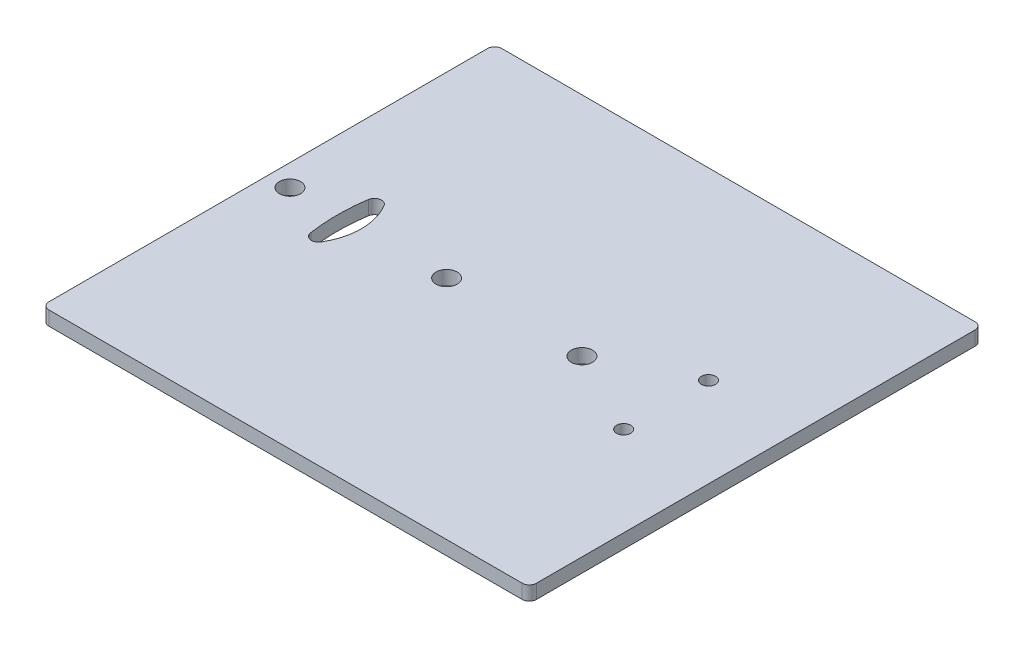
ISO-10303-21;
HEADER;
FILE_DESCRIPTION(('STEP AP214'),'2;1');
FILE_NAME('part.step','',(''),(''),'','','');
FILE_SCHEMA(('AUTOMOTIVE_DESIGN { 1 0 10303 214 1 1 1 1 }'));
ENDSEC;
DATA;
#1=APPLICATION_CONTEXT('core data for automotive mechanical design processes');
#2=APPLICATION_PROTOCOL_DEFINITION('international standard','automotive_design',2000,#1);
#3=PRODUCT_CONTEXT('',#1,'mechanical');
#4=PRODUCT('Part','Part','',(#3));
#5=PRODUCT_RELATED_PRODUCT_CATEGORY('part','',(#4));
#6=PRODUCT_DEFINITION_FORMATION('','',#4);
#7=PRODUCT_DEFINITION_CONTEXT('part definition',#1,'design');
#8=PRODUCT_DEFINITION('design','',#6,#7);
#9=PRODUCT_DEFINITION_SHAPE('','',#8);
#10=(LENGTH_UNIT() NAMED_UNIT(*) SI_UNIT(.MILLI.,.METRE.));
#11=(NAMED_UNIT(*) PLANE_ANGLE_UNIT() SI_UNIT($,.RADIAN.));
#12=(NAMED_UNIT(*) SI_UNIT($,.STERADIAN.) SOLID_ANGLE_UNIT());
#13=UNCERTAINTY_MEASURE_WITH_UNIT(LENGTH_MEASURE(1.E-05),#10,'distance_accuracy_value','');
#14=(GEOMETRIC_REPRESENTATION_CONTEXT(3) GLOBAL_UNCERTAINTY_ASSIGNED_CONTEXT((#13)) GLOBAL_UNIT_ASSIGNED_CONTEXT((#10,
#11,#12)) REPRESENTATION_CONTEXT('',''));
#15=CARTESIAN_POINT('',(0.,0.,0.));
#16=DIRECTION('',(0.,0.,1.));
#17=DIRECTION('',(1.,0.,0.));
#18=AXIS2_PLACEMENT_3D('',#15,#16,#17);
#19=CARTESIAN_POINT('',(-0.529110391776749,2.,0.));
#20=DIRECTION('',(-1.,0.,0.));
#21=DIRECTION('',(0.,0.,1.));
#22=AXIS2_PLACEMENT_3D('',#19,#20,#21);
#23=PLANE('',#22);
#24=DIRECTION('',(0.,0.,-1.));
#25=VECTOR('',#24,1.);
#26=CARTESIAN_POINT('',(-0.529110391776749,0.,0.));
#27=LINE('',#26,#25);
#28=CARTESIAN_POINT('',(-0.529110391776749,0.,30.3399870721143));
#29=VERTEX_POINT('',#28);
#30=CARTESIAN_POINT('',(-0.529110391776749,0.,-31.7592451910248));
#31=VERTEX_POINT('',#30);
#32=EDGE_CURVE('E198',#29,#31,#27,.T.);
#33=ORIENTED_EDGE('',*,*,#32,.T.);
#34=DIRECTION('',(0.,-1.,0.));
#35=VECTOR('',#34,1.);
#36=CARTESIAN_POINT('',(-0.529110391776749,2.,-31.7592451910248));
#37=LINE('',#36,#35);
#38=CARTESIAN_POINT('',(-0.529110391776749,2.,-31.7592451910248));
#39=VERTEX_POINT('',#38);
#40=EDGE_CURVE('E229',#31,#39,#37,.F.);
#41=ORIENTED_EDGE('',*,*,#40,.T.);
#42=DIRECTION('',(0.,0.,-1.));
#43=VECTOR('',#42,1.);
#44=CARTESIAN_POINT('',(-0.529110391776749,2.,0.));
#45=LINE('',#44,#43);
#46=CARTESIAN_POINT('',(-0.529110391776749,2.,30.3399870721143));
#47=VERTEX_POINT('',#46);
#48=EDGE_CURVE('E163',#47,#39,#45,.T.);
#49=ORIENTED_EDGE('',*,*,#48,.F.);
#50=DIRECTION('',(0.,-1.,0.));
#51=VECTOR('',#50,1.);
#52=CARTESIAN_POINT('',(-0.529110391776749,2.,30.3399870721143));
#53=LINE('',#52,#51);
#54=EDGE_CURVE('E226',#47,#29,#53,.T.);
#55=ORIENTED_EDGE('',*,*,#54,.T.);
#56=EDGE_LOOP('',(#33,#41,#49,#55));
#57=FACE_BOUND('',#56,.T.);
#58=ADVANCED_FACE('F39',(#57),#23,.F.);
#59=CARTESIAN_POINT('',(0.,2.,-32.7592451910248));
#60=DIRECTION('',(0.,0.,1.));
#61=DIRECTION('',(1.,0.,0.));
#62=AXIS2_PLACEMENT_3D('',#59,#60,#61);
#63=PLANE('',#62);
#64=DIRECTION('',(-1.,0.,0.));
#65=VECTOR('',#64,1.);
#66=CARTESIAN_POINT('',(0.,2.,-32.7592451910248));
#67=LINE('',#66,#65);
#68=CARTESIAN_POINT('',(-1.52911039177675,2.,-32.7592451910248));
#69=VERTEX_POINT('',#68);
#70=CARTESIAN_POINT('',(-68.5291103917768,2.,-32.7592451910248));
#71=VERTEX_POINT('',#70);
#72=EDGE_CURVE('E166',#69,#71,#67,.T.);
#73=ORIENTED_EDGE('',*,*,#72,.F.);
#74=DIRECTION('',(0.,-1.,0.));
#75=VECTOR('',#74,1.);
#76=CARTESIAN_POINT('',(-1.52911039177675,2.,-32.7592451910248));
#77=LINE('',#76,#75);
#78=CARTESIAN_POINT('',(-1.52911039177675,0.,-32.7592451910248));
#79=VERTEX_POINT('',#78);
#80=EDGE_CURVE('E215',#69,#79,#77,.T.);
#81=ORIENTED_EDGE('',*,*,#80,.T.);
#82=DIRECTION('',(-1.,0.,0.));
#83=VECTOR('',#82,1.);
#84=CARTESIAN_POINT('',(0.,0.,-32.7592451910248));
#85=LINE('',#84,#83);
#86=CARTESIAN_POINT('',(-68.5291103917768,0.,-32.7592451910248));
#87=VERTEX_POINT('',#86);
#88=EDGE_CURVE('E201',#79,#87,#85,.T.);
#89=ORIENTED_EDGE('',*,*,#88,.T.);
#90=DIRECTION('',(0.,-1.,0.));
#91=VECTOR('',#90,1.);
#92=CARTESIAN_POINT('',(-68.5291103917768,2.,-32.7592451910248));
#93=LINE('',#92,#91);
#94=EDGE_CURVE('E139',#87,#71,#93,.F.);
#95=ORIENTED_EDGE('',*,*,#94,.T.);
#96=EDGE_LOOP('',(#73,#81,#89,#95));
#97=FACE_BOUND('',#96,.T.);
#98=ADVANCED_FACE('F265',(#97),#63,.F.);
#99=CARTESIAN_POINT('',(-69.5291103917768,2.,0.));
#100=DIRECTION('',(1.,0.,0.));
#101=DIRECTION('',(0.,0.,-1.));
#102=AXIS2_PLACEMENT_3D('',#99,#100,#101);
#103=PLANE('',#102);
#104=DIRECTION('',(0.,0.,1.));
#105=VECTOR('',#104,1.);
#106=CARTESIAN_POINT('',(-69.5291103917768,2.,0.));
#107=LINE('',#106,#105);
#108=CARTESIAN_POINT('',(-69.5291103917768,2.,-31.7592451910248));
#109=VERTEX_POINT('',#108);
#110=CARTESIAN_POINT('',(-69.5291103917768,2.,30.3399870721143));
#111=VERTEX_POINT('',#110);
#112=EDGE_CURVE('E169',#109,#111,#107,.T.);
#113=ORIENTED_EDGE('',*,*,#112,.F.);
#114=DIRECTION('',(0.,-1.,0.));
#115=VECTOR('',#114,1.);
#116=CARTESIAN_POINT('',(-69.5291103917768,2.,-31.7592451910248));
#117=LINE('',#116,#115);
#118=CARTESIAN_POINT('',(-69.5291103917768,0.,-31.7592451910248));
#119=VERTEX_POINT('',#118);
#120=EDGE_CURVE('E240',#109,#119,#117,.T.);
#121=ORIENTED_EDGE('',*,*,#120,.T.);
#122=DIRECTION('',(0.,0.,1.));
#123=VECTOR('',#122,1.);
#124=CARTESIAN_POINT('',(-69.5291103917768,0.,0.));
#125=LINE('',#124,#123);
#126=CARTESIAN_POINT('',(-69.5291103917768,0.,30.3399870721143));
#127=VERTEX_POINT('',#126);
#128=EDGE_CURVE('E204',#119,#127,#125,.T.);
#129=ORIENTED_EDGE('',*,*,#128,.T.);
#130=DIRECTION('',(0.,-1.,0.));
#131=VECTOR('',#130,1.);
#132=CARTESIAN_POINT('',(-69.5291103917768,2.,30.3399870721143));
#133=LINE('',#132,#131);
#134=EDGE_CURVE('E238',#127,#111,#133,.F.);
#135=ORIENTED_EDGE('',*,*,#134,.T.);
#136=EDGE_LOOP('',(#113,#121,#129,#135));
#137=FACE_BOUND('',#136,.T.);
#138=ADVANCED_FACE('F273',(#137),#103,.F.);
#139=CARTESIAN_POINT('',(-32.4352056165024,2.,-0.709629059459614));
#140=DIRECTION('',(0.,-1.,0.));
#141=DIRECTION('',(0.,0.,-1.));
#142=AXIS2_PLACEMENT_3D('',#139,#140,#141);
#143=CYLINDRICAL_SURFACE('',#142,27.3286368918132);
#144=CARTESIAN_POINT('',(-32.4352056165024,0.,-0.709629059459614));
#145=DIRECTION('',(0.,1.,0.));
#146=DIRECTION('',(0.,0.,1.));
#147=AXIS2_PLACEMENT_3D('',#144,#145,#146);
#148=CIRCLE('',#147,27.3286368918132);
#149=CARTESIAN_POINT('',(-59.45438417212,0.,-4.81065143738257));
#150=VERTEX_POINT('',#149);
#151=CARTESIAN_POINT('',(-59.4694550126896,0.,3.29084015668525));
#152=VERTEX_POINT('',#151);
#153=EDGE_CURVE('E134',#150,#152,#148,.T.);
#154=ORIENTED_EDGE('',*,*,#153,.F.);
#155=DIRECTION('',(0.,-1.,0.));
#156=VECTOR('',#155,1.);
#157=CARTESIAN_POINT('',(-59.45438417212,2.,-4.81065143738257));
#158=LINE('',#157,#156);
#159=CARTESIAN_POINT('',(-59.45438417212,2.,-4.81065143738257));
#160=VERTEX_POINT('',#159);
#161=EDGE_CURVE('E128',#160,#150,#158,.T.);
#162=ORIENTED_EDGE('',*,*,#161,.F.);
#163=CARTESIAN_POINT('',(-32.4352056165024,2.,-0.709629059459614));
#164=DIRECTION('',(0.,1.,0.));
#165=DIRECTION('',(0.,0.,1.));
#166=AXIS2_PLACEMENT_3D('',#163,#164,#165);
#167=CIRCLE('',#166,27.3286368918132);
#168=CARTESIAN_POINT('',(-59.4694550126896,2.,3.29084015668525));
#169=VERTEX_POINT('',#168);
#170=EDGE_CURVE('E131',#160,#169,#167,.T.);
#171=ORIENTED_EDGE('',*,*,#170,.T.);
#172=DIRECTION('',(0.,-1.,0.));
#173=VECTOR('',#172,1.);
#174=CARTESIAN_POINT('',(-59.4694550126896,2.,3.29084015668525));
#175=LINE('',#174,#173);
#176=EDGE_CURVE('E173',#169,#152,#175,.T.);
#177=ORIENTED_EDGE('',*,*,#176,.T.);
#178=EDGE_LOOP('',(#154,#162,#171,#177));
#179=FACE_BOUND('',#178,.T.);
#180=ADVANCED_FACE('F130',(#179),#143,.F.);
#181=CARTESIAN_POINT('',(-58.4657077641975,2.,-4.66058824930049));
#182=DIRECTION('',(0.,-1.,0.));
#183=DIRECTION('',(0.,0.,-1.));
#184=AXIS2_PLACEMENT_3D('',#181,#182,#183);
#185=CYLINDRICAL_SURFACE('',#184,0.999999999999993);
#186=CARTESIAN_POINT('',(-58.4657077641975,0.,-4.66058824930049));
#187=DIRECTION('',(0.,1.,0.));
#188=DIRECTION('',(0.,0.,1.));
#189=AXIS2_PLACEMENT_3D('',#186,#187,#188);
#190=CIRCLE('',#189,0.999999999999993);
#191=CARTESIAN_POINT('',(-57.6114728373144,0.,-5.18047543869167));
#192=VERTEX_POINT('',#191);
#193=EDGE_CURVE('E187',#192,#150,#190,.T.);
#194=ORIENTED_EDGE('',*,*,#193,.F.);
#195=DIRECTION('',(0.,-1.,0.));
#196=VECTOR('',#195,1.);
#197=CARTESIAN_POINT('',(-57.6114728373144,2.,-5.18047543869167));
#198=LINE('',#197,#196);
#199=CARTESIAN_POINT('',(-57.6114728373144,2.,-5.18047543869167));
#200=VERTEX_POINT('',#199);
#201=EDGE_CURVE('E140',#200,#192,#198,.T.);
#202=ORIENTED_EDGE('',*,*,#201,.F.);
#203=CARTESIAN_POINT('',(-58.4657077641975,2.,-4.66058824930049));
#204=DIRECTION('',(0.,1.,0.));
#205=DIRECTION('',(0.,0.,1.));
#206=AXIS2_PLACEMENT_3D('',#203,#204,#205);
#207=CIRCLE('',#206,0.999999999999993);
#208=EDGE_CURVE('E147',#200,#160,#207,.T.);
#209=ORIENTED_EDGE('',*,*,#208,.T.);
#210=ORIENTED_EDGE('',*,*,#161,.T.);
#211=EDGE_LOOP('',(#194,#202,#209,#210));
#212=FACE_BOUND('',#211,.T.);
#213=ADVANCED_FACE('F153',(#212),#185,.F.);
#214=CARTESIAN_POINT('',(-64.957591779666,2.,-0.709629059455225));
#215=DIRECTION('',(0.,-1.,0.));
#216=DIRECTION('',(0.,0.,-1.));
#217=AXIS2_PLACEMENT_3D('',#214,#215,#216);
#218=CYLINDRICAL_SURFACE('',#217,8.59964713589512);
#219=CARTESIAN_POINT('',(-64.957591779666,0.,-0.709629059455225));
#220=DIRECTION('',(0.,1.,0.));
#221=DIRECTION('',(0.,0.,1.));
#222=AXIS2_PLACEMENT_3D('',#219,#220,#221);
#223=CIRCLE('',#222,8.59964713589512);
#224=CARTESIAN_POINT('',(-57.5568414613941,0.,3.67019120951779));
#225=VERTEX_POINT('',#224);
#226=EDGE_CURVE('E189',#225,#192,#223,.T.);
#227=ORIENTED_EDGE('',*,*,#226,.F.);
#228=DIRECTION('',(0.,-1.,0.));
#229=VECTOR('',#228,1.);
#230=CARTESIAN_POINT('',(-57.5568414613941,2.,3.67019120951779));
#231=LINE('',#230,#229);
#232=CARTESIAN_POINT('',(-57.5568414613941,2.,3.67019120951779));
#233=VERTEX_POINT('',#232);
#234=EDGE_CURVE('E211',#233,#225,#231,.T.);
#235=ORIENTED_EDGE('',*,*,#234,.F.);
#236=CARTESIAN_POINT('',(-64.957591779666,2.,-0.709629059455225));
#237=DIRECTION('',(0.,1.,0.));
#238=DIRECTION('',(0.,0.,1.));
#239=AXIS2_PLACEMENT_3D('',#236,#237,#238);
#240=CIRCLE('',#239,8.59964713589512);
#241=EDGE_CURVE('E154',#233,#200,#240,.T.);
#242=ORIENTED_EDGE('',*,*,#241,.T.);
#243=ORIENTED_EDGE('',*,*,#201,.T.);
#244=EDGE_LOOP('',(#227,#235,#242,#243));
#245=FACE_BOUND('',#244,.T.);
#246=ADVANCED_FACE('F291',(#245),#218,.F.);
#247=CARTESIAN_POINT('',(-66.457591779666,2.,-0.709629059455225));
#248=DIRECTION('',(0.,-1.,0.));
#249=DIRECTION('',(0.,0.,-1.));
#250=AXIS2_PLACEMENT_3D('',#247,#248,#249);
#251=CYLINDRICAL_SURFACE('',#250,1.5);
#252=CARTESIAN_POINT('',(-66.457591779666,2.,-0.709629059455225));
#253=DIRECTION('',(0.,1.,0.));
#254=DIRECTION('',(0.,0.,1.));
#255=AXIS2_PLACEMENT_3D('',#252,#253,#254);
#256=CIRCLE('',#255,1.5);
#257=CARTESIAN_POINT('',(-66.457591779666,2.,0.790370940544772));
#258=VERTEX_POINT('',#257);
#259=EDGE_CURVE('E160',#258,#258,#256,.T.);
#260=ORIENTED_EDGE('',*,*,#259,.T.);
#261=EDGE_LOOP('',(#260));
#262=FACE_BOUND('',#261,.T.);
#263=CARTESIAN_POINT('',(-66.457591779666,0.,-0.709629059455225));
#264=DIRECTION('',(0.,1.,0.));
#265=DIRECTION('',(0.,0.,1.));
#266=AXIS2_PLACEMENT_3D('',#263,#264,#265);
#267=CIRCLE('',#266,1.5);
#268=CARTESIAN_POINT('',(-66.457591779666,0.,0.790370940544772));
#269=VERTEX_POINT('',#268);
#270=EDGE_CURVE('E195',#269,#269,#267,.T.);
#271=ORIENTED_EDGE('',*,*,#270,.F.);
#272=EDGE_LOOP('',(#271));
#273=FACE_BOUND('',#272,.T.);
#274=ADVANCED_FACE('F287',(#262,#273),#251,.F.);
#275=CARTESIAN_POINT('',(-58.4657077641964,2.,3.24133013038831));
#276=DIRECTION('',(0.,-1.,0.));
#277=DIRECTION('',(0.,0.,-1.));
#278=AXIS2_PLACEMENT_3D('',#275,#276,#277);
#279=CYLINDRICAL_SURFACE('',#278,1.00496755249194);
#280=CARTESIAN_POINT('',(-58.4657077641964,0.,3.24133013038831));
#281=DIRECTION('',(0.,1.,0.));
#282=DIRECTION('',(0.,0.,1.));
#283=AXIS2_PLACEMENT_3D('',#280,#281,#282);
#284=CIRCLE('',#283,1.00496755249194);
#285=EDGE_CURVE('E192',#152,#225,#284,.T.);
#286=ORIENTED_EDGE('',*,*,#285,.F.);
#287=ORIENTED_EDGE('',*,*,#176,.F.);
#288=CARTESIAN_POINT('',(-58.4657077641964,2.,3.24133013038831));
#289=DIRECTION('',(0.,1.,0.));
#290=DIRECTION('',(0.,0.,1.));
#291=AXIS2_PLACEMENT_3D('',#288,#289,#290);
#292=CIRCLE('',#291,1.00496755249194);
#293=EDGE_CURVE('E150',#169,#233,#292,.T.);
#294=ORIENTED_EDGE('',*,*,#293,.T.);
#295=ORIENTED_EDGE('',*,*,#234,.T.);
#296=EDGE_LOOP('',(#286,#287,#294,#295));
#297=FACE_BOUND('',#296,.T.);
#298=ADVANCED_FACE('F290',(#297),#279,.F.);
#299=CARTESIAN_POINT('',(-44.2865932675491,2.,-0.709629059455225));
#300=DIRECTION('',(0.,-1.,0.));
#301=DIRECTION('',(0.,0.,-1.));
#302=AXIS2_PLACEMENT_3D('',#299,#300,#301);
#303=CYLINDRICAL_SURFACE('',#302,1.5);
#304=CARTESIAN_POINT('',(-44.2865932675491,2.,-0.709629059455225));
#305=DIRECTION('',(0.,1.,0.));
#306=DIRECTION('',(0.,0.,1.));
#307=AXIS2_PLACEMENT_3D('',#304,#305,#306);
#308=CIRCLE('',#307,1.5);
#309=CARTESIAN_POINT('',(-44.2865932675491,2.,0.790370940544779));
#310=VERTEX_POINT('',#309);
#311=EDGE_CURVE('E151',#310,#310,#308,.T.);
#312=ORIENTED_EDGE('',*,*,#311,.T.);
#313=EDGE_LOOP('',(#312));
#314=FACE_BOUND('',#313,.T.);
#315=CARTESIAN_POINT('',(-44.2865932675491,0.,-0.709629059455225));
#316=DIRECTION('',(0.,1.,0.));
#317=DIRECTION('',(0.,0.,1.));
#318=AXIS2_PLACEMENT_3D('',#315,#316,#317);
#319=CIRCLE('',#318,1.5);
#320=CARTESIAN_POINT('',(-44.2865932675491,0.,0.790370940544779));
#321=VERTEX_POINT('',#320);
#322=EDGE_CURVE('E183',#321,#321,#319,.T.);
#323=ORIENTED_EDGE('',*,*,#322,.F.);
#324=EDGE_LOOP('',(#323));
#325=FACE_BOUND('',#324,.T.);
#326=ADVANCED_FACE('F295',(#314,#325),#303,.F.);
#327=CARTESIAN_POINT('',(-25.1300853571439,2.,-0.709629059455225));
#328=DIRECTION('',(0.,-1.,0.));
#329=DIRECTION('',(0.,0.,-1.));
#330=AXIS2_PLACEMENT_3D('',#327,#328,#329);
#331=CYLINDRICAL_SURFACE('',#330,1.5);
#332=CARTESIAN_POINT('',(-25.1300853571439,2.,-0.709629059455225));
#333=DIRECTION('',(0.,1.,0.));
#334=DIRECTION('',(0.,0.,1.));
#335=AXIS2_PLACEMENT_3D('',#332,#333,#334);
#336=CIRCLE('',#335,1.5);
#337=CARTESIAN_POINT('',(-25.1300853571439,2.,0.790370940544775));
#338=VERTEX_POINT('',#337);
#339=EDGE_CURVE('E451',#338,#338,#336,.T.);
#340=ORIENTED_EDGE('',*,*,#339,.T.);
#341=EDGE_LOOP('',(#340));
#342=FACE_BOUND('',#341,.T.);
#343=CARTESIAN_POINT('',(-25.1300853571439,0.,-0.709629059455225));
#344=DIRECTION('',(0.,1.,0.));
#345=DIRECTION('',(0.,0.,1.));
#346=AXIS2_PLACEMENT_3D('',#343,#344,#345);
#347=CIRCLE('',#346,1.5);
#348=CARTESIAN_POINT('',(-25.1300853571439,0.,0.790370940544775));
#349=VERTEX_POINT('',#348);
#350=EDGE_CURVE('E180',#349,#349,#347,.T.);
#351=ORIENTED_EDGE('',*,*,#350,.F.);
#352=EDGE_LOOP('',(#351));
#353=FACE_BOUND('',#352,.T.);
#354=ADVANCED_FACE('F306',(#342,#353),#331,.F.);
#355=CARTESIAN_POINT('',(-13.2219858452704,2.,-6.70962905945516));
#356=DIRECTION('',(0.,-1.,0.));
#357=DIRECTION('',(0.,0.,-1.));
#358=AXIS2_PLACEMENT_3D('',#355,#356,#357);
#359=CYLINDRICAL_SURFACE('',#358,1.);
#360=CARTESIAN_POINT('',(-13.2219858452704,2.,-6.70962905945516));
#361=DIRECTION('',(0.,1.,0.));
#362=DIRECTION('',(0.,0.,1.));
#363=AXIS2_PLACEMENT_3D('',#360,#361,#362);
#364=CIRCLE('',#363,1.);
#365=CARTESIAN_POINT('',(-13.2219858452704,2.,-5.70962905945516));
#366=VERTEX_POINT('',#365);
#367=EDGE_CURVE('E447',#366,#366,#364,.T.);
#368=ORIENTED_EDGE('',*,*,#367,.T.);
#369=EDGE_LOOP('',(#368));
#370=FACE_BOUND('',#369,.T.);
#371=CARTESIAN_POINT('',(-13.2219858452704,0.,-6.70962905945516));
#372=DIRECTION('',(0.,1.,0.));
#373=DIRECTION('',(0.,0.,1.));
#374=AXIS2_PLACEMENT_3D('',#371,#372,#373);
#375=CIRCLE('',#374,1.);
#376=CARTESIAN_POINT('',(-13.2219858452704,0.,-5.70962905945516));
#377=VERTEX_POINT('',#376);
#378=EDGE_CURVE('E177',#377,#377,#375,.T.);
#379=ORIENTED_EDGE('',*,*,#378,.F.);
#380=EDGE_LOOP('',(#379));
#381=FACE_BOUND('',#380,.T.);
#382=ADVANCED_FACE('F310',(#370,#381),#359,.F.);
#383=CARTESIAN_POINT('',(-13.2219858452704,2.,5.29037094054474));
#384=DIRECTION('',(0.,-1.,0.));
#385=DIRECTION('',(0.,0.,-1.));
#386=AXIS2_PLACEMENT_3D('',#383,#384,#385);
#387=CYLINDRICAL_SURFACE('',#386,1.);
#388=CARTESIAN_POINT('',(-13.2219858452704,2.,5.29037094054474));
#389=DIRECTION('',(0.,1.,0.));
#390=DIRECTION('',(0.,0.,1.));
#391=AXIS2_PLACEMENT_3D('',#388,#389,#390);
#392=CIRCLE('',#391,1.);
#393=CARTESIAN_POINT('',(-13.2219858452704,2.,6.29037094054474));
#394=VERTEX_POINT('',#393);
#395=EDGE_CURVE('E209',#394,#394,#392,.T.);
#396=ORIENTED_EDGE('',*,*,#395,.T.);
#397=EDGE_LOOP('',(#396));
#398=FACE_BOUND('',#397,.T.);
#399=CARTESIAN_POINT('',(-13.2219858452704,0.,5.29037094054474));
#400=DIRECTION('',(0.,1.,0.));
#401=DIRECTION('',(0.,0.,1.));
#402=AXIS2_PLACEMENT_3D('',#399,#400,#401);
#403=CIRCLE('',#402,1.);
#404=CARTESIAN_POINT('',(-13.2219858452704,0.,6.29037094054474));
#405=VERTEX_POINT('',#404);
#406=EDGE_CURVE('E174',#405,#405,#403,.T.);
#407=ORIENTED_EDGE('',*,*,#406,.F.);
#408=EDGE_LOOP('',(#407));
#409=FACE_BOUND('',#408,.T.);
#410=ADVANCED_FACE('F314',(#398,#409),#387,.F.);
#411=CARTESIAN_POINT('',(0.,2.,31.3399870721143));
#412=DIRECTION('',(0.,0.,-1.));
#413=DIRECTION('',(-1.,0.,0.));
#414=AXIS2_PLACEMENT_3D('',#411,#412,#413);
#415=PLANE('',#414);
#416=DIRECTION('',(1.,0.,0.));
#417=VECTOR('',#416,1.);
#418=CARTESIAN_POINT('',(0.,0.,31.3399870721143));
#419=LINE('',#418,#417);
#420=CARTESIAN_POINT('',(-68.5291103917768,0.,31.3399870721143));
#421=VERTEX_POINT('',#420);
#422=CARTESIAN_POINT('',(-1.52911039177675,0.,31.3399870721143));
#423=VERTEX_POINT('',#422);
#424=EDGE_CURVE('E207',#421,#423,#419,.T.);
#425=ORIENTED_EDGE('',*,*,#424,.T.);
#426=DIRECTION('',(0.,-1.,0.));
#427=VECTOR('',#426,1.);
#428=CARTESIAN_POINT('',(-1.52911039177675,2.,31.3399870721143));
#429=LINE('',#428,#427);
#430=CARTESIAN_POINT('',(-1.52911039177675,2.,31.3399870721143));
#431=VERTEX_POINT('',#430);
#432=EDGE_CURVE('E11',#423,#431,#429,.F.);
#433=ORIENTED_EDGE('',*,*,#432,.T.);
#434=DIRECTION('',(1.,0.,0.));
#435=VECTOR('',#434,1.);
#436=CARTESIAN_POINT('',(0.,2.,31.3399870721143));
#437=LINE('',#436,#435);
#438=CARTESIAN_POINT('',(-68.5291103917768,2.,31.3399870721143));
#439=VERTEX_POINT('',#438);
#440=EDGE_CURVE('E171',#439,#431,#437,.T.);
#441=ORIENTED_EDGE('',*,*,#440,.F.);
#442=DIRECTION('',(0.,-1.,0.));
#443=VECTOR('',#442,1.);
#444=CARTESIAN_POINT('',(-68.5291103917768,2.,31.3399870721143));
#445=LINE('',#444,#443);
#446=EDGE_CURVE('E47',#439,#421,#445,.T.);
#447=ORIENTED_EDGE('',*,*,#446,.T.);
#448=EDGE_LOOP('',(#425,#433,#441,#447));
#449=FACE_BOUND('',#448,.T.);
#450=ADVANCED_FACE('F245',(#449),#415,.F.);
#451=CARTESIAN_POINT('',(0.,2.,0.));
#452=DIRECTION('',(0.,1.,0.));
#453=DIRECTION('',(0.,0.,1.));
#454=AXIS2_PLACEMENT_3D('',#451,#452,#453);
#455=PLANE('',#454);
#456=ORIENTED_EDGE('',*,*,#395,.F.);
#457=EDGE_LOOP('',(#456));
#458=FACE_BOUND('',#457,.T.);
#459=ORIENTED_EDGE('',*,*,#367,.F.);
#460=EDGE_LOOP('',(#459));
#461=FACE_BOUND('',#460,.T.);
#462=ORIENTED_EDGE('',*,*,#339,.F.);
#463=EDGE_LOOP('',(#462));
#464=FACE_BOUND('',#463,.T.);
#465=ORIENTED_EDGE('',*,*,#311,.F.);
#466=EDGE_LOOP('',(#465));
#467=FACE_BOUND('',#466,.T.);
#468=ORIENTED_EDGE('',*,*,#170,.F.);
#469=ORIENTED_EDGE('',*,*,#208,.F.);
#470=ORIENTED_EDGE('',*,*,#241,.F.);
#471=ORIENTED_EDGE('',*,*,#293,.F.);
#472=EDGE_LOOP('',(#468,#469,#470,#471));
#473=FACE_BOUND('',#472,.T.);
#474=ORIENTED_EDGE('',*,*,#259,.F.);
#475=EDGE_LOOP('',(#474));
#476=FACE_BOUND('',#475,.T.);
#477=ORIENTED_EDGE('',*,*,#48,.T.);
#478=CARTESIAN_POINT('',(-1.52911039177675,2.,-31.7592451910248));
#479=DIRECTION('',(0.,1.,0.));
#480=DIRECTION('',(0.,0.,1.));
#481=AXIS2_PLACEMENT_3D('',#478,#479,#480);
#482=CIRCLE('',#481,1.);
#483=EDGE_CURVE('E236',#39,#69,#482,.T.);
#484=ORIENTED_EDGE('',*,*,#483,.T.);
#485=ORIENTED_EDGE('',*,*,#72,.T.);
#486=CARTESIAN_POINT('',(-68.5291103917768,2.,-31.7592451910248));
#487=DIRECTION('',(0.,1.,0.));
#488=DIRECTION('',(0.,0.,1.));
#489=AXIS2_PLACEMENT_3D('',#486,#487,#488);
#490=CIRCLE('',#489,1.);
#491=EDGE_CURVE('E234',#71,#109,#490,.T.);
#492=ORIENTED_EDGE('',*,*,#491,.T.);
#493=ORIENTED_EDGE('',*,*,#112,.T.);
#494=CARTESIAN_POINT('',(-68.5291103917768,2.,30.3399870721143));
#495=DIRECTION('',(0.,1.,0.));
#496=DIRECTION('',(0.,0.,1.));
#497=AXIS2_PLACEMENT_3D('',#494,#495,#496);
#498=CIRCLE('',#497,1.);
#499=EDGE_CURVE('E59',#111,#439,#498,.T.);
#500=ORIENTED_EDGE('',*,*,#499,.T.);
#501=ORIENTED_EDGE('',*,*,#440,.T.);
#502=CARTESIAN_POINT('',(-1.52911039177675,2.,30.3399870721143));
#503=DIRECTION('',(0.,1.,0.));
#504=DIRECTION('',(0.,0.,1.));
#505=AXIS2_PLACEMENT_3D('',#502,#503,#504);
#506=CIRCLE('',#505,1.);
#507=EDGE_CURVE('E232',#431,#47,#506,.T.);
#508=ORIENTED_EDGE('',*,*,#507,.T.);
#509=EDGE_LOOP('',(#477,#484,#485,#492,#493,#500,#501,#508));
#510=FACE_BOUND('',#509,.T.);
#511=ADVANCED_FACE('F144',(#458,#461,#464,#467,#473,#476,#510),#455,.T.);
#512=CARTESIAN_POINT('',(0.,0.,0.));
#513=DIRECTION('',(0.,1.,0.));
#514=DIRECTION('',(0.,0.,1.));
#515=AXIS2_PLACEMENT_3D('',#512,#513,#514);
#516=PLANE('',#515);
#517=ORIENTED_EDGE('',*,*,#406,.T.);
#518=EDGE_LOOP('',(#517));
#519=FACE_BOUND('',#518,.T.);
#520=ORIENTED_EDGE('',*,*,#378,.T.);
#521=EDGE_LOOP('',(#520));
#522=FACE_BOUND('',#521,.T.);
#523=ORIENTED_EDGE('',*,*,#350,.T.);
#524=EDGE_LOOP('',(#523));
#525=FACE_BOUND('',#524,.T.);
#526=ORIENTED_EDGE('',*,*,#322,.T.);
#527=EDGE_LOOP('',(#526));
#528=FACE_BOUND('',#527,.T.);
#529=ORIENTED_EDGE('',*,*,#153,.T.);
#530=ORIENTED_EDGE('',*,*,#285,.T.);
#531=ORIENTED_EDGE('',*,*,#226,.T.);
#532=ORIENTED_EDGE('',*,*,#193,.T.);
#533=EDGE_LOOP('',(#529,#530,#531,#532));
#534=FACE_BOUND('',#533,.T.);
#535=ORIENTED_EDGE('',*,*,#270,.T.);
#536=EDGE_LOOP('',(#535));
#537=FACE_BOUND('',#536,.T.);
#538=ORIENTED_EDGE('',*,*,#88,.F.);
#539=CARTESIAN_POINT('',(-1.52911039177675,0.,-31.7592451910248));
#540=DIRECTION('',(0.,1.,0.));
#541=DIRECTION('',(0.,0.,1.));
#542=AXIS2_PLACEMENT_3D('',#539,#540,#541);
#543=CIRCLE('',#542,1.);
#544=EDGE_CURVE('E224',#79,#31,#543,.F.);
#545=ORIENTED_EDGE('',*,*,#544,.T.);
#546=ORIENTED_EDGE('',*,*,#32,.F.);
#547=CARTESIAN_POINT('',(-1.52911039177675,0.,30.3399870721143));
#548=DIRECTION('',(0.,1.,0.));
#549=DIRECTION('',(0.,0.,1.));
#550=AXIS2_PLACEMENT_3D('',#547,#548,#549);
#551=CIRCLE('',#550,1.);
#552=EDGE_CURVE('E220',#29,#423,#551,.F.);
#553=ORIENTED_EDGE('',*,*,#552,.T.);
#554=ORIENTED_EDGE('',*,*,#424,.F.);
#555=CARTESIAN_POINT('',(-68.5291103917768,0.,30.3399870721143));
#556=DIRECTION('',(0.,1.,0.));
#557=DIRECTION('',(0.,0.,1.));
#558=AXIS2_PLACEMENT_3D('',#555,#556,#557);
#559=CIRCLE('',#558,1.);
#560=EDGE_CURVE('E218',#421,#127,#559,.F.);
#561=ORIENTED_EDGE('',*,*,#560,.T.);
#562=ORIENTED_EDGE('',*,*,#128,.F.);
#563=CARTESIAN_POINT('',(-68.5291103917768,0.,-31.7592451910248));
#564=DIRECTION('',(0.,1.,0.));
#565=DIRECTION('',(0.,0.,1.));
#566=AXIS2_PLACEMENT_3D('',#563,#564,#565);
#567=CIRCLE('',#566,1.);
#568=EDGE_CURVE('E222',#119,#87,#567,.F.);
#569=ORIENTED_EDGE('',*,*,#568,.T.);
#570=EDGE_LOOP('',(#538,#545,#546,#553,#554,#561,#562,#569));
#571=FACE_BOUND('',#570,.T.);
#572=ADVANCED_FACE('F249',(#519,#522,#525,#528,#534,#537,#571),#516,.F.);
#573=CARTESIAN_POINT('',(-1.52911039177675,2.,-31.7592451910248));
#574=DIRECTION('',(0.,-1.,0.));
#575=DIRECTION('',(0.,0.,-1.));
#576=AXIS2_PLACEMENT_3D('',#573,#574,#575);
#577=CYLINDRICAL_SURFACE('',#576,1.);
#578=ORIENTED_EDGE('',*,*,#483,.F.);
#579=ORIENTED_EDGE('',*,*,#40,.F.);
#580=ORIENTED_EDGE('',*,*,#544,.F.);
#581=ORIENTED_EDGE('',*,*,#80,.F.);
#582=EDGE_LOOP('',(#578,#579,#580,#581));
#583=FACE_BOUND('',#582,.T.);
#584=ADVANCED_FACE('F263',(#583),#577,.T.);
#585=CARTESIAN_POINT('',(-68.5291103917768,2.,-31.7592451910248));
#586=DIRECTION('',(0.,-1.,0.));
#587=DIRECTION('',(0.,0.,-1.));
#588=AXIS2_PLACEMENT_3D('',#585,#586,#587);
#589=CYLINDRICAL_SURFACE('',#588,1.);
#590=ORIENTED_EDGE('',*,*,#491,.F.);
#591=ORIENTED_EDGE('',*,*,#94,.F.);
#592=ORIENTED_EDGE('',*,*,#568,.F.);
#593=ORIENTED_EDGE('',*,*,#120,.F.);
#594=EDGE_LOOP('',(#590,#591,#592,#593));
#595=FACE_BOUND('',#594,.T.);
#596=ADVANCED_FACE('F270',(#595),#589,.T.);
#597=CARTESIAN_POINT('',(-1.52911039177675,2.,30.3399870721143));
#598=DIRECTION('',(0.,-1.,0.));
#599=DIRECTION('',(0.,0.,-1.));
#600=AXIS2_PLACEMENT_3D('',#597,#598,#599);
#601=CYLINDRICAL_SURFACE('',#600,1.);
#602=ORIENTED_EDGE('',*,*,#507,.F.);
#603=ORIENTED_EDGE('',*,*,#432,.F.);
#604=ORIENTED_EDGE('',*,*,#552,.F.);
#605=ORIENTED_EDGE('',*,*,#54,.F.);
#606=EDGE_LOOP('',(#602,#603,#604,#605));
#607=FACE_BOUND('',#606,.T.);
#608=ADVANCED_FACE('F255',(#607),#601,.T.);
#609=CARTESIAN_POINT('',(-68.5291103917768,2.,30.3399870721143));
#610=DIRECTION('',(0.,-1.,0.));
#611=DIRECTION('',(0.,0.,-1.));
#612=AXIS2_PLACEMENT_3D('',#609,#610,#611);
#613=CYLINDRICAL_SURFACE('',#612,1.);
#614=ORIENTED_EDGE('',*,*,#499,.F.);
#615=ORIENTED_EDGE('',*,*,#134,.F.);
#616=ORIENTED_EDGE('',*,*,#560,.F.);
#617=ORIENTED_EDGE('',*,*,#446,.F.);
#618=EDGE_LOOP('',(#614,#615,#616,#617));
#619=FACE_BOUND('',#618,.T.);
#620=ADVANCED_FACE('F41',(#619),#613,.T.);
#621=CLOSED_SHELL('',(#58,#98,#138,#180,#213,#246,#274,#298,#326,#354,#382,#410,#450,#511,#572,
#584,#596,#608,#620));
#622=MANIFOLD_SOLID_BREP('B2',#621);
#623=ADVANCED_BREP_SHAPE_REPRESENTATION('',(#18,#622),#14);
#624=SHAPE_DEFINITION_REPRESENTATION(#9,#623);
ENDSEC;
END-ISO-10303-21;
